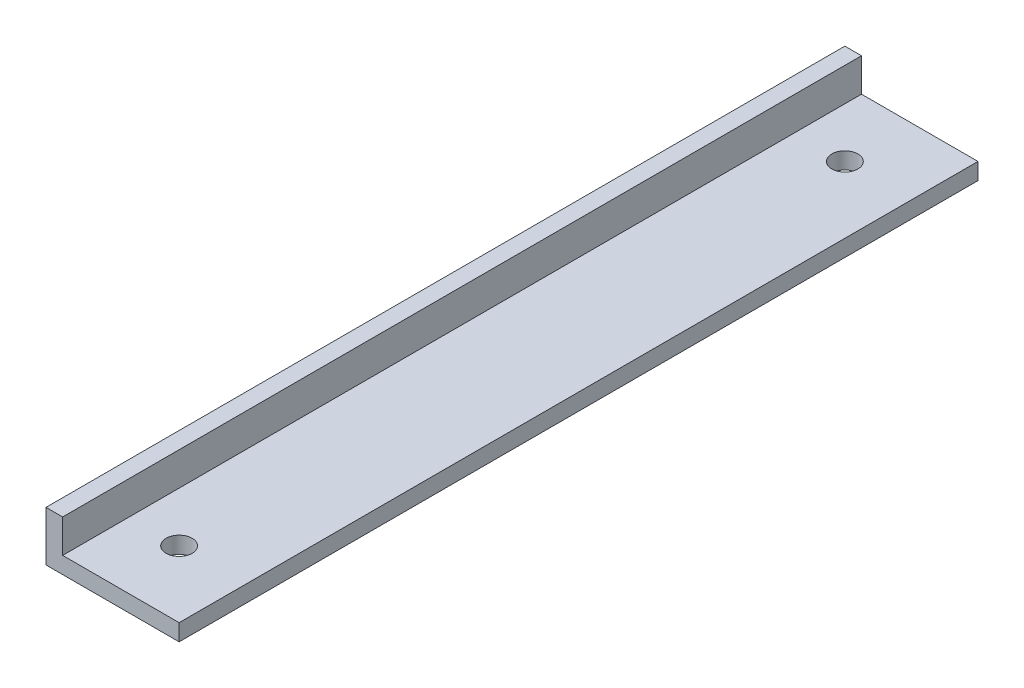
ISO-10303-21;
HEADER;
FILE_DESCRIPTION(('STEP AP214'),'2;1');
FILE_NAME('part.step','',(''),(''),'','','');
FILE_SCHEMA(('AUTOMOTIVE_DESIGN { 1 0 10303 214 1 1 1 1 }'));
ENDSEC;
DATA;
#1=APPLICATION_CONTEXT('core data for automotive mechanical design processes');
#2=APPLICATION_PROTOCOL_DEFINITION('international standard','automotive_design',2000,#1);
#3=PRODUCT_CONTEXT('',#1,'mechanical');
#4=PRODUCT('Part','Part','',(#3));
#5=PRODUCT_RELATED_PRODUCT_CATEGORY('part','',(#4));
#6=PRODUCT_DEFINITION_FORMATION('','',#4);
#7=PRODUCT_DEFINITION_CONTEXT('part definition',#1,'design');
#8=PRODUCT_DEFINITION('design','',#6,#7);
#9=PRODUCT_DEFINITION_SHAPE('','',#8);
#10=(LENGTH_UNIT() NAMED_UNIT(*) SI_UNIT(.MILLI.,.METRE.));
#11=(NAMED_UNIT(*) PLANE_ANGLE_UNIT() SI_UNIT($,.RADIAN.));
#12=(NAMED_UNIT(*) SI_UNIT($,.STERADIAN.) SOLID_ANGLE_UNIT());
#13=UNCERTAINTY_MEASURE_WITH_UNIT(LENGTH_MEASURE(1.E-05),#10,'distance_accuracy_value','');
#14=(GEOMETRIC_REPRESENTATION_CONTEXT(3) GLOBAL_UNCERTAINTY_ASSIGNED_CONTEXT((#13)) GLOBAL_UNIT_ASSIGNED_CONTEXT((#10,
#11,#12)) REPRESENTATION_CONTEXT('',''));
#15=CARTESIAN_POINT('',(0.,0.,0.));
#16=DIRECTION('',(0.,0.,1.));
#17=DIRECTION('',(1.,0.,0.));
#18=AXIS2_PLACEMENT_3D('',#15,#16,#17);
#19=CARTESIAN_POINT('',(0.,9.525,76.2));
#20=DIRECTION('',(0.,1.,0.));
#21=DIRECTION('',(0.,0.,1.));
#22=AXIS2_PLACEMENT_3D('',#19,#20,#21);
#23=PLANE('',#22);
#24=DIRECTION('',(1.,0.,0.));
#25=VECTOR('',#24,1.);
#26=CARTESIAN_POINT('',(0.,9.525,-76.2));
#27=LINE('',#26,#25);
#28=CARTESIAN_POINT('',(0.,9.525,-76.2));
#29=VERTEX_POINT('',#28);
#30=CARTESIAN_POINT('',(3.175,9.525,-76.2));
#31=VERTEX_POINT('',#30);
#32=EDGE_CURVE('E115',#29,#31,#27,.T.);
#33=ORIENTED_EDGE('',*,*,#32,.F.);
#34=DIRECTION('',(0.,0.,-1.));
#35=VECTOR('',#34,1.);
#36=CARTESIAN_POINT('',(0.,9.525,76.2));
#37=LINE('',#36,#35);
#38=CARTESIAN_POINT('',(0.,9.525,76.2));
#39=VERTEX_POINT('',#38);
#40=EDGE_CURVE('E11',#39,#29,#37,.T.);
#41=ORIENTED_EDGE('',*,*,#40,.F.);
#42=DIRECTION('',(1.,0.,0.));
#43=VECTOR('',#42,1.);
#44=CARTESIAN_POINT('',(0.,9.525,76.2));
#45=LINE('',#44,#43);
#46=CARTESIAN_POINT('',(3.175,9.525,76.2));
#47=VERTEX_POINT('',#46);
#48=EDGE_CURVE('E127',#39,#47,#45,.T.);
#49=ORIENTED_EDGE('',*,*,#48,.T.);
#50=DIRECTION('',(0.,0.,-1.));
#51=VECTOR('',#50,1.);
#52=CARTESIAN_POINT('',(3.175,9.525,76.2));
#53=LINE('',#52,#51);
#54=EDGE_CURVE('E79',#47,#31,#53,.T.);
#55=ORIENTED_EDGE('',*,*,#54,.T.);
#56=EDGE_LOOP('',(#33,#41,#49,#55));
#57=FACE_BOUND('',#56,.T.);
#58=ADVANCED_FACE('F34',(#57),#23,.T.);
#59=CARTESIAN_POINT('',(0.,0.,76.2));
#60=DIRECTION('',(1.,0.,0.));
#61=DIRECTION('',(0.,0.,-1.));
#62=AXIS2_PLACEMENT_3D('',#59,#60,#61);
#63=PLANE('',#62);
#64=DIRECTION('',(0.,-1.,0.));
#65=VECTOR('',#64,1.);
#66=CARTESIAN_POINT('',(0.,0.,-76.2));
#67=LINE('',#66,#65);
#68=CARTESIAN_POINT('',(0.,0.,-76.2));
#69=VERTEX_POINT('',#68);
#70=EDGE_CURVE('E118',#29,#69,#67,.T.);
#71=ORIENTED_EDGE('',*,*,#70,.T.);
#72=DIRECTION('',(0.,0.,-1.));
#73=VECTOR('',#72,1.);
#74=CARTESIAN_POINT('',(0.,0.,76.2));
#75=LINE('',#74,#73);
#76=CARTESIAN_POINT('',(0.,0.,76.2));
#77=VERTEX_POINT('',#76);
#78=EDGE_CURVE('E42',#77,#69,#75,.T.);
#79=ORIENTED_EDGE('',*,*,#78,.F.);
#80=DIRECTION('',(0.,-1.,0.));
#81=VECTOR('',#80,1.);
#82=CARTESIAN_POINT('',(0.,0.,76.2));
#83=LINE('',#82,#81);
#84=EDGE_CURVE('E142',#39,#77,#83,.T.);
#85=ORIENTED_EDGE('',*,*,#84,.F.);
#86=ORIENTED_EDGE('',*,*,#40,.T.);
#87=EDGE_LOOP('',(#71,#79,#85,#86));
#88=FACE_BOUND('',#87,.T.);
#89=ADVANCED_FACE('F182',(#88),#63,.F.);
#90=CARTESIAN_POINT('',(0.,0.,76.2));
#91=DIRECTION('',(0.,1.,0.));
#92=DIRECTION('',(0.,0.,1.));
#93=AXIS2_PLACEMENT_3D('',#90,#91,#92);
#94=PLANE('',#93);
#95=CARTESIAN_POINT('',(12.7,0.,-63.5));
#96=DIRECTION('',(0.,1.,0.));
#97=DIRECTION('',(-1.,0.,0.));
#98=AXIS2_PLACEMENT_3D('',#95,#96,#97);
#99=CIRCLE('',#98,2.4892);
#100=CARTESIAN_POINT('',(10.2108,0.,-63.5));
#101=VERTEX_POINT('',#100);
#102=EDGE_CURVE('E119',#101,#101,#99,.T.);
#103=ORIENTED_EDGE('',*,*,#102,.T.);
#104=EDGE_LOOP('',(#103));
#105=FACE_BOUND('',#104,.T.);
#106=CARTESIAN_POINT('',(12.7,0.,63.5));
#107=DIRECTION('',(0.,1.,0.));
#108=DIRECTION('',(-1.,0.,0.));
#109=AXIS2_PLACEMENT_3D('',#106,#107,#108);
#110=CIRCLE('',#109,2.4892);
#111=CARTESIAN_POINT('',(10.2108,0.,63.5));
#112=VERTEX_POINT('',#111);
#113=EDGE_CURVE('E149',#112,#112,#110,.T.);
#114=ORIENTED_EDGE('',*,*,#113,.T.);
#115=EDGE_LOOP('',(#114));
#116=FACE_BOUND('',#115,.T.);
#117=DIRECTION('',(1.,0.,0.));
#118=VECTOR('',#117,1.);
#119=CARTESIAN_POINT('',(0.,0.,-76.2));
#120=LINE('',#119,#118);
#121=CARTESIAN_POINT('',(25.4,0.,-76.2));
#122=VERTEX_POINT('',#121);
#123=EDGE_CURVE('E121',#69,#122,#120,.T.);
#124=ORIENTED_EDGE('',*,*,#123,.T.);
#125=DIRECTION('',(0.,0.,-1.));
#126=VECTOR('',#125,1.);
#127=CARTESIAN_POINT('',(25.4,0.,76.2));
#128=LINE('',#127,#126);
#129=CARTESIAN_POINT('',(25.4,0.,76.2));
#130=VERTEX_POINT('',#129);
#131=EDGE_CURVE('E107',#130,#122,#128,.T.);
#132=ORIENTED_EDGE('',*,*,#131,.F.);
#133=DIRECTION('',(1.,0.,0.));
#134=VECTOR('',#133,1.);
#135=CARTESIAN_POINT('',(0.,0.,76.2));
#136=LINE('',#135,#134);
#137=EDGE_CURVE('E98',#77,#130,#136,.T.);
#138=ORIENTED_EDGE('',*,*,#137,.F.);
#139=ORIENTED_EDGE('',*,*,#78,.T.);
#140=EDGE_LOOP('',(#124,#132,#138,#139));
#141=FACE_BOUND('',#140,.T.);
#142=ADVANCED_FACE('F134',(#105,#116,#141),#94,.F.);
#143=CARTESIAN_POINT('',(25.4,0.,76.2));
#144=DIRECTION('',(-1.,0.,0.));
#145=DIRECTION('',(0.,-1.,0.));
#146=AXIS2_PLACEMENT_3D('',#143,#144,#145);
#147=PLANE('',#146);
#148=DIRECTION('',(0.,1.,0.));
#149=VECTOR('',#148,1.);
#150=CARTESIAN_POINT('',(25.4,0.,-76.2));
#151=LINE('',#150,#149);
#152=CARTESIAN_POINT('',(25.4,3.175,-76.2));
#153=VERTEX_POINT('',#152);
#154=EDGE_CURVE('E106',#122,#153,#151,.T.);
#155=ORIENTED_EDGE('',*,*,#154,.T.);
#156=DIRECTION('',(0.,0.,-1.));
#157=VECTOR('',#156,1.);
#158=CARTESIAN_POINT('',(25.4,3.175,76.2));
#159=LINE('',#158,#157);
#160=CARTESIAN_POINT('',(25.4,3.175,76.2));
#161=VERTEX_POINT('',#160);
#162=EDGE_CURVE('E103',#161,#153,#159,.T.);
#163=ORIENTED_EDGE('',*,*,#162,.F.);
#164=DIRECTION('',(0.,1.,0.));
#165=VECTOR('',#164,1.);
#166=CARTESIAN_POINT('',(25.4,0.,76.2));
#167=LINE('',#166,#165);
#168=EDGE_CURVE('E92',#130,#161,#167,.T.);
#169=ORIENTED_EDGE('',*,*,#168,.F.);
#170=ORIENTED_EDGE('',*,*,#131,.T.);
#171=EDGE_LOOP('',(#155,#163,#169,#170));
#172=FACE_BOUND('',#171,.T.);
#173=ADVANCED_FACE('F104',(#172),#147,.F.);
#174=CARTESIAN_POINT('',(0.,3.175,76.2));
#175=DIRECTION('',(0.,-1.,0.));
#176=DIRECTION('',(1.,0.,0.));
#177=AXIS2_PLACEMENT_3D('',#174,#175,#176);
#178=PLANE('',#177);
#179=CARTESIAN_POINT('',(12.7,3.175,-63.5));
#180=DIRECTION('',(0.,1.,0.));
#181=DIRECTION('',(-1.,0.,0.));
#182=AXIS2_PLACEMENT_3D('',#179,#180,#181);
#183=CIRCLE('',#182,2.4892);
#184=CARTESIAN_POINT('',(10.2108,3.175,-63.5));
#185=VERTEX_POINT('',#184);
#186=EDGE_CURVE('E152',#185,#185,#183,.T.);
#187=ORIENTED_EDGE('',*,*,#186,.F.);
#188=EDGE_LOOP('',(#187));
#189=FACE_BOUND('',#188,.T.);
#190=CARTESIAN_POINT('',(12.7,3.175,63.5));
#191=DIRECTION('',(0.,1.,0.));
#192=DIRECTION('',(-1.,0.,0.));
#193=AXIS2_PLACEMENT_3D('',#190,#191,#192);
#194=CIRCLE('',#193,2.4892);
#195=CARTESIAN_POINT('',(10.2108,3.175,63.5));
#196=VERTEX_POINT('',#195);
#197=EDGE_CURVE('E146',#196,#196,#194,.T.);
#198=ORIENTED_EDGE('',*,*,#197,.F.);
#199=EDGE_LOOP('',(#198));
#200=FACE_BOUND('',#199,.T.);
#201=DIRECTION('',(-1.,0.,0.));
#202=VECTOR('',#201,1.);
#203=CARTESIAN_POINT('',(0.,3.175,-76.2));
#204=LINE('',#203,#202);
#205=CARTESIAN_POINT('',(3.175,3.175,-76.2));
#206=VERTEX_POINT('',#205);
#207=EDGE_CURVE('E72',#153,#206,#204,.T.);
#208=ORIENTED_EDGE('',*,*,#207,.T.);
#209=DIRECTION('',(0.,0.,-1.));
#210=VECTOR('',#209,1.);
#211=CARTESIAN_POINT('',(3.175,3.175,76.2));
#212=LINE('',#211,#210);
#213=CARTESIAN_POINT('',(3.175,3.175,76.2));
#214=VERTEX_POINT('',#213);
#215=EDGE_CURVE('E108',#214,#206,#212,.T.);
#216=ORIENTED_EDGE('',*,*,#215,.F.);
#217=DIRECTION('',(-1.,0.,0.));
#218=VECTOR('',#217,1.);
#219=CARTESIAN_POINT('',(0.,3.175,76.2));
#220=LINE('',#219,#218);
#221=EDGE_CURVE('E96',#161,#214,#220,.T.);
#222=ORIENTED_EDGE('',*,*,#221,.F.);
#223=ORIENTED_EDGE('',*,*,#162,.T.);
#224=EDGE_LOOP('',(#208,#216,#222,#223));
#225=FACE_BOUND('',#224,.T.);
#226=ADVANCED_FACE('F110',(#189,#200,#225),#178,.F.);
#227=CARTESIAN_POINT('',(3.175,0.,76.2));
#228=DIRECTION('',(-1.,0.,0.));
#229=DIRECTION('',(0.,-1.,0.));
#230=AXIS2_PLACEMENT_3D('',#227,#228,#229);
#231=PLANE('',#230);
#232=DIRECTION('',(0.,1.,0.));
#233=VECTOR('',#232,1.);
#234=CARTESIAN_POINT('',(3.175,0.,-76.2));
#235=LINE('',#234,#233);
#236=EDGE_CURVE('E125',#206,#31,#235,.T.);
#237=ORIENTED_EDGE('',*,*,#236,.T.);
#238=ORIENTED_EDGE('',*,*,#54,.F.);
#239=DIRECTION('',(0.,1.,0.));
#240=VECTOR('',#239,1.);
#241=CARTESIAN_POINT('',(3.175,0.,76.2));
#242=LINE('',#241,#240);
#243=EDGE_CURVE('E50',#214,#47,#242,.T.);
#244=ORIENTED_EDGE('',*,*,#243,.F.);
#245=ORIENTED_EDGE('',*,*,#215,.T.);
#246=EDGE_LOOP('',(#237,#238,#244,#245));
#247=FACE_BOUND('',#246,.T.);
#248=ADVANCED_FACE('F141',(#247),#231,.F.);
#249=CARTESIAN_POINT('',(0.,0.,76.2));
#250=DIRECTION('',(0.,0.,1.));
#251=DIRECTION('',(1.,0.,0.));
#252=AXIS2_PLACEMENT_3D('',#249,#250,#251);
#253=PLANE('',#252);
#254=ORIENTED_EDGE('',*,*,#48,.F.);
#255=ORIENTED_EDGE('',*,*,#84,.T.);
#256=ORIENTED_EDGE('',*,*,#137,.T.);
#257=ORIENTED_EDGE('',*,*,#168,.T.);
#258=ORIENTED_EDGE('',*,*,#221,.T.);
#259=ORIENTED_EDGE('',*,*,#243,.T.);
#260=EDGE_LOOP('',(#254,#255,#256,#257,#258,#259));
#261=FACE_BOUND('',#260,.T.);
#262=ADVANCED_FACE('F94',(#261),#253,.T.);
#263=CARTESIAN_POINT('',(0.,0.,-76.2));
#264=DIRECTION('',(0.,0.,1.));
#265=DIRECTION('',(1.,0.,0.));
#266=AXIS2_PLACEMENT_3D('',#263,#264,#265);
#267=PLANE('',#266);
#268=ORIENTED_EDGE('',*,*,#32,.T.);
#269=ORIENTED_EDGE('',*,*,#236,.F.);
#270=ORIENTED_EDGE('',*,*,#207,.F.);
#271=ORIENTED_EDGE('',*,*,#154,.F.);
#272=ORIENTED_EDGE('',*,*,#123,.F.);
#273=ORIENTED_EDGE('',*,*,#70,.F.);
#274=EDGE_LOOP('',(#268,#269,#270,#271,#272,#273));
#275=FACE_BOUND('',#274,.T.);
#276=ADVANCED_FACE('F138',(#275),#267,.F.);
#277=CARTESIAN_POINT('',(12.7,0.,63.5));
#278=DIRECTION('',(0.,1.,0.));
#279=DIRECTION('',(-1.,0.,0.));
#280=AXIS2_PLACEMENT_3D('',#277,#278,#279);
#281=CYLINDRICAL_SURFACE('',#280,2.4892);
#282=ORIENTED_EDGE('',*,*,#113,.F.);
#283=EDGE_LOOP('',(#282));
#284=FACE_BOUND('',#283,.T.);
#285=ORIENTED_EDGE('',*,*,#197,.T.);
#286=EDGE_LOOP('',(#285));
#287=FACE_BOUND('',#286,.T.);
#288=ADVANCED_FACE('F163',(#284,#287),#281,.F.);
#289=CARTESIAN_POINT('',(12.7,0.,-63.5));
#290=DIRECTION('',(0.,1.,0.));
#291=DIRECTION('',(-1.,0.,0.));
#292=AXIS2_PLACEMENT_3D('',#289,#290,#291);
#293=CYLINDRICAL_SURFACE('',#292,2.4892);
#294=ORIENTED_EDGE('',*,*,#102,.F.);
#295=EDGE_LOOP('',(#294));
#296=FACE_BOUND('',#295,.T.);
#297=ORIENTED_EDGE('',*,*,#186,.T.);
#298=EDGE_LOOP('',(#297));
#299=FACE_BOUND('',#298,.T.);
#300=ADVANCED_FACE('F160',(#296,#299),#293,.F.);
#301=CLOSED_SHELL('',(#58,#89,#142,#173,#226,#248,#262,#276,#288,#300));
#302=MANIFOLD_SOLID_BREP('B2',#301);
#303=ADVANCED_BREP_SHAPE_REPRESENTATION('',(#18,#302),#14);
#304=SHAPE_DEFINITION_REPRESENTATION(#9,#303);
ENDSEC;
END-ISO-10303-21;
